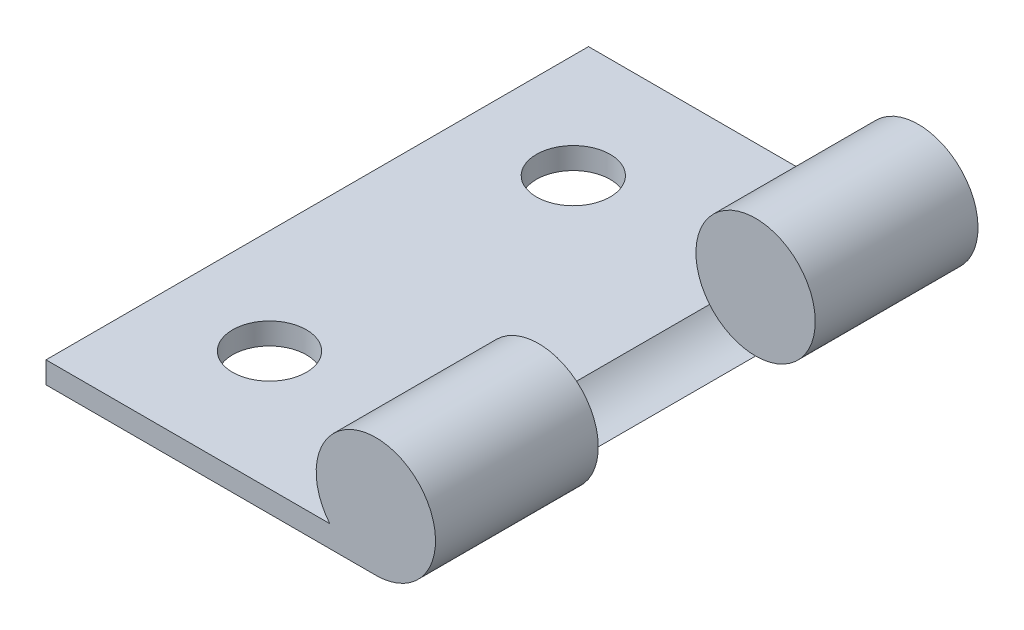
ISO-10303-21;
HEADER;
FILE_DESCRIPTION(('STEP AP214'),'2;1');
FILE_NAME('part.step','',(''),(''),'','','');
FILE_SCHEMA(('AUTOMOTIVE_DESIGN { 1 0 10303 214 1 1 1 1 }'));
ENDSEC;
DATA;
#1=APPLICATION_CONTEXT('core data for automotive mechanical design processes');
#2=APPLICATION_PROTOCOL_DEFINITION('international standard','automotive_design',2000,#1);
#3=PRODUCT_CONTEXT('',#1,'mechanical');
#4=PRODUCT('Part','Part','',(#3));
#5=PRODUCT_RELATED_PRODUCT_CATEGORY('part','',(#4));
#6=PRODUCT_DEFINITION_FORMATION('','',#4);
#7=PRODUCT_DEFINITION_CONTEXT('part definition',#1,'design');
#8=PRODUCT_DEFINITION('design','',#6,#7);
#9=PRODUCT_DEFINITION_SHAPE('','',#8);
#10=(LENGTH_UNIT() NAMED_UNIT(*) SI_UNIT(.MILLI.,.METRE.));
#11=(NAMED_UNIT(*) PLANE_ANGLE_UNIT() SI_UNIT($,.RADIAN.));
#12=(NAMED_UNIT(*) SI_UNIT($,.STERADIAN.) SOLID_ANGLE_UNIT());
#13=UNCERTAINTY_MEASURE_WITH_UNIT(LENGTH_MEASURE(1.E-05),#10,'distance_accuracy_value','');
#14=(GEOMETRIC_REPRESENTATION_CONTEXT(3) GLOBAL_UNCERTAINTY_ASSIGNED_CONTEXT((#13)) GLOBAL_UNIT_ASSIGNED_CONTEXT((#10,
#11,#12)) REPRESENTATION_CONTEXT('',''));
#15=CARTESIAN_POINT('',(0.,0.,0.));
#16=DIRECTION('',(0.,0.,1.));
#17=DIRECTION('',(1.,0.,0.));
#18=AXIS2_PLACEMENT_3D('',#15,#16,#17);
#19=CARTESIAN_POINT('',(0.,0.,25.));
#20=DIRECTION('',(0.,0.,-1.));
#21=DIRECTION('',(-1.,0.,0.));
#22=AXIS2_PLACEMENT_3D('',#19,#20,#21);
#23=CYLINDRICAL_SURFACE('',#22,2.75);
#24=CARTESIAN_POINT('',(0.,0.,17.5));
#25=DIRECTION('',(0.,0.,-1.));
#26=DIRECTION('',(-1.,0.,0.));
#27=AXIS2_PLACEMENT_3D('',#24,#25,#26);
#28=CIRCLE('',#27,2.75);
#29=CARTESIAN_POINT('',(-2.12132034355964,-1.75,17.5));
#30=VERTEX_POINT('',#29);
#31=CARTESIAN_POINT('',(0.,-2.75,17.5));
#32=VERTEX_POINT('',#31);
#33=EDGE_CURVE('E110',#30,#32,#28,.T.);
#34=ORIENTED_EDGE('',*,*,#33,.F.);
#35=DIRECTION('',(0.,0.,-1.));
#36=VECTOR('',#35,1.);
#37=CARTESIAN_POINT('',(-2.12132034355964,-1.75,25.));
#38=LINE('',#37,#36);
#39=CARTESIAN_POINT('',(-2.12132034355964,-1.75,25.));
#40=VERTEX_POINT('',#39);
#41=EDGE_CURVE('E11',#40,#30,#38,.T.);
#42=ORIENTED_EDGE('',*,*,#41,.F.);
#43=CARTESIAN_POINT('',(0.,0.,25.));
#44=DIRECTION('',(0.,0.,1.));
#45=DIRECTION('',(1.,0.,0.));
#46=AXIS2_PLACEMENT_3D('',#43,#44,#45);
#47=CIRCLE('',#46,2.75);
#48=CARTESIAN_POINT('',(0.,-2.75,25.));
#49=VERTEX_POINT('',#48);
#50=EDGE_CURVE('E147',#49,#40,#47,.T.);
#51=ORIENTED_EDGE('',*,*,#50,.F.);
#52=DIRECTION('',(0.,0.,-1.));
#53=VECTOR('',#52,1.);
#54=CARTESIAN_POINT('',(0.,-2.75,25.));
#55=LINE('',#54,#53);
#56=EDGE_CURVE('E105',#49,#32,#55,.T.);
#57=ORIENTED_EDGE('',*,*,#56,.T.);
#58=EDGE_LOOP('',(#34,#42,#51,#57));
#59=FACE_BOUND('',#58,.T.);
#60=ADVANCED_FACE('F34',(#59),#23,.T.);
#61=CARTESIAN_POINT('',(-2.12132034355964,-1.75,7.5));
#62=VERTEX_POINT('',#61);
#63=CARTESIAN_POINT('',(-2.12132034355964,-1.75,0.));
#64=VERTEX_POINT('',#63);
#65=EDGE_CURVE('E43',#62,#64,#38,.T.);
#66=ORIENTED_EDGE('',*,*,#65,.F.);
#67=CARTESIAN_POINT('',(0.,0.,7.5));
#68=DIRECTION('',(0.,0.,-1.));
#69=DIRECTION('',(-1.,0.,0.));
#70=AXIS2_PLACEMENT_3D('',#67,#68,#69);
#71=CIRCLE('',#70,2.75);
#72=CARTESIAN_POINT('',(0.,-2.75,7.5));
#73=VERTEX_POINT('',#72);
#74=EDGE_CURVE('E109',#62,#73,#71,.T.);
#75=ORIENTED_EDGE('',*,*,#74,.T.);
#76=CARTESIAN_POINT('',(0.,-2.75,0.));
#77=VERTEX_POINT('',#76);
#78=EDGE_CURVE('E82',#73,#77,#55,.T.);
#79=ORIENTED_EDGE('',*,*,#78,.T.);
#80=CARTESIAN_POINT('',(0.,0.,0.));
#81=DIRECTION('',(0.,0.,1.));
#82=DIRECTION('',(1.,0.,0.));
#83=AXIS2_PLACEMENT_3D('',#80,#81,#82);
#84=CIRCLE('',#83,2.75);
#85=EDGE_CURVE('E136',#77,#64,#84,.T.);
#86=ORIENTED_EDGE('',*,*,#85,.T.);
#87=EDGE_LOOP('',(#66,#75,#79,#86));
#88=FACE_BOUND('',#87,.T.);
#89=ADVANCED_FACE('F36',(#88),#23,.T.);
#90=CARTESIAN_POINT('',(-15.2,-1.75000000000001,25.));
#91=DIRECTION('',(0.,-1.,0.));
#92=DIRECTION('',(1.,0.,0.));
#93=AXIS2_PLACEMENT_3D('',#90,#91,#92);
#94=PLANE('',#93);
#95=CARTESIAN_POINT('',(-10.4,-1.75000000000001,5.5));
#96=DIRECTION('',(0.,1.,0.));
#97=DIRECTION('',(-1.,0.,0.));
#98=AXIS2_PLACEMENT_3D('',#95,#96,#97);
#99=CIRCLE('',#98,1.7);
#100=CARTESIAN_POINT('',(-12.1,-1.75000000000001,5.5));
#101=VERTEX_POINT('',#100);
#102=EDGE_CURVE('E132',#101,#101,#99,.T.);
#103=ORIENTED_EDGE('',*,*,#102,.F.);
#104=EDGE_LOOP('',(#103));
#105=FACE_BOUND('',#104,.T.);
#106=CARTESIAN_POINT('',(-10.4,-1.75000000000001,19.5));
#107=DIRECTION('',(0.,1.,0.));
#108=DIRECTION('',(1.,0.,0.));
#109=AXIS2_PLACEMENT_3D('',#106,#107,#108);
#110=CIRCLE('',#109,1.7);
#111=CARTESIAN_POINT('',(-8.7,-1.75,19.5));
#112=VERTEX_POINT('',#111);
#113=EDGE_CURVE('E138',#112,#112,#110,.T.);
#114=ORIENTED_EDGE('',*,*,#113,.F.);
#115=EDGE_LOOP('',(#114));
#116=FACE_BOUND('',#115,.T.);
#117=DIRECTION('',(-1.,0.,0.));
#118=VECTOR('',#117,1.);
#119=CARTESIAN_POINT('',(-15.2,-1.75000000000001,0.));
#120=LINE('',#119,#118);
#121=CARTESIAN_POINT('',(-15.2,-1.75000000000001,0.));
#122=VERTEX_POINT('',#121);
#123=EDGE_CURVE('E152',#64,#122,#120,.T.);
#124=ORIENTED_EDGE('',*,*,#123,.T.);
#125=DIRECTION('',(0.,0.,-1.));
#126=VECTOR('',#125,1.);
#127=CARTESIAN_POINT('',(-15.2,-1.75000000000001,25.));
#128=LINE('',#127,#126);
#129=CARTESIAN_POINT('',(-15.2,-1.75000000000001,25.));
#130=VERTEX_POINT('',#129);
#131=EDGE_CURVE('E126',#130,#122,#128,.T.);
#132=ORIENTED_EDGE('',*,*,#131,.F.);
#133=DIRECTION('',(-1.,0.,0.));
#134=VECTOR('',#133,1.);
#135=CARTESIAN_POINT('',(-15.2,-1.75000000000001,25.));
#136=LINE('',#135,#134);
#137=EDGE_CURVE('E89',#40,#130,#136,.T.);
#138=ORIENTED_EDGE('',*,*,#137,.F.);
#139=ORIENTED_EDGE('',*,*,#41,.T.);
#140=DIRECTION('',(0.,0.,-1.));
#141=VECTOR('',#140,1.);
#142=CARTESIAN_POINT('',(-2.12132034355964,-1.75,17.5));
#143=LINE('',#142,#141);
#144=EDGE_CURVE('E143',#30,#62,#143,.T.);
#145=ORIENTED_EDGE('',*,*,#144,.T.);
#146=ORIENTED_EDGE('',*,*,#65,.T.);
#147=EDGE_LOOP('',(#124,#132,#138,#139,#145,#146));
#148=FACE_BOUND('',#147,.T.);
#149=ADVANCED_FACE('F162',(#105,#116,#148),#94,.F.);
#150=CARTESIAN_POINT('',(-15.2,-2.75000000000001,25.));
#151=DIRECTION('',(1.,0.,0.));
#152=DIRECTION('',(0.,1.,0.));
#153=AXIS2_PLACEMENT_3D('',#150,#151,#152);
#154=PLANE('',#153);
#155=DIRECTION('',(0.,-1.,0.));
#156=VECTOR('',#155,1.);
#157=CARTESIAN_POINT('',(-15.2,-2.75000000000001,0.));
#158=LINE('',#157,#156);
#159=CARTESIAN_POINT('',(-15.2,-2.75000000000001,0.));
#160=VERTEX_POINT('',#159);
#161=EDGE_CURVE('E154',#122,#160,#158,.T.);
#162=ORIENTED_EDGE('',*,*,#161,.T.);
#163=DIRECTION('',(0.,0.,-1.));
#164=VECTOR('',#163,1.);
#165=CARTESIAN_POINT('',(-15.2,-2.75000000000001,25.));
#166=LINE('',#165,#164);
#167=CARTESIAN_POINT('',(-15.2,-2.75000000000001,25.));
#168=VERTEX_POINT('',#167);
#169=EDGE_CURVE('E122',#168,#160,#166,.T.);
#170=ORIENTED_EDGE('',*,*,#169,.F.);
#171=DIRECTION('',(0.,-1.,0.));
#172=VECTOR('',#171,1.);
#173=CARTESIAN_POINT('',(-15.2,-2.75000000000001,25.));
#174=LINE('',#173,#172);
#175=EDGE_CURVE('E118',#130,#168,#174,.T.);
#176=ORIENTED_EDGE('',*,*,#175,.F.);
#177=ORIENTED_EDGE('',*,*,#131,.T.);
#178=EDGE_LOOP('',(#162,#170,#176,#177));
#179=FACE_BOUND('',#178,.T.);
#180=ADVANCED_FACE('F157',(#179),#154,.F.);
#181=CARTESIAN_POINT('',(0.,-2.75,25.));
#182=DIRECTION('',(0.,1.,0.));
#183=DIRECTION('',(-1.,0.,0.));
#184=AXIS2_PLACEMENT_3D('',#181,#182,#183);
#185=PLANE('',#184);
#186=CARTESIAN_POINT('',(-10.4,-2.75,5.5));
#187=DIRECTION('',(0.,1.,0.));
#188=DIRECTION('',(-1.,0.,0.));
#189=AXIS2_PLACEMENT_3D('',#186,#187,#188);
#190=CIRCLE('',#189,1.7);
#191=CARTESIAN_POINT('',(-12.1,-2.75,5.5));
#192=VERTEX_POINT('',#191);
#193=EDGE_CURVE('E38',#192,#192,#190,.T.);
#194=ORIENTED_EDGE('',*,*,#193,.T.);
#195=EDGE_LOOP('',(#194));
#196=FACE_BOUND('',#195,.T.);
#197=CARTESIAN_POINT('',(-10.4,-2.75,19.5));
#198=DIRECTION('',(0.,1.,0.));
#199=DIRECTION('',(-1.,0.,0.));
#200=AXIS2_PLACEMENT_3D('',#197,#198,#199);
#201=CIRCLE('',#200,1.7);
#202=CARTESIAN_POINT('',(-12.1,-2.75,19.5));
#203=VERTEX_POINT('',#202);
#204=EDGE_CURVE('E130',#203,#203,#201,.T.);
#205=ORIENTED_EDGE('',*,*,#204,.T.);
#206=EDGE_LOOP('',(#205));
#207=FACE_BOUND('',#206,.T.);
#208=DIRECTION('',(1.,0.,0.));
#209=VECTOR('',#208,1.);
#210=CARTESIAN_POINT('',(0.,-2.75,0.));
#211=LINE('',#210,#209);
#212=EDGE_CURVE('E116',#160,#77,#211,.T.);
#213=ORIENTED_EDGE('',*,*,#212,.T.);
#214=ORIENTED_EDGE('',*,*,#78,.F.);
#215=EDGE_CURVE('E98',#32,#73,#55,.T.);
#216=ORIENTED_EDGE('',*,*,#215,.F.);
#217=ORIENTED_EDGE('',*,*,#56,.F.);
#218=DIRECTION('',(1.,0.,0.));
#219=VECTOR('',#218,1.);
#220=CARTESIAN_POINT('',(0.,-2.75,25.));
#221=LINE('',#220,#219);
#222=EDGE_CURVE('E60',#168,#49,#221,.T.);
#223=ORIENTED_EDGE('',*,*,#222,.F.);
#224=ORIENTED_EDGE('',*,*,#169,.T.);
#225=EDGE_LOOP('',(#213,#214,#216,#217,#223,#224));
#226=FACE_BOUND('',#225,.T.);
#227=ADVANCED_FACE('F113',(#196,#207,#226),#185,.F.);
#228=CARTESIAN_POINT('',(0.,0.,25.));
#229=DIRECTION('',(0.,0.,1.));
#230=DIRECTION('',(1.,0.,0.));
#231=AXIS2_PLACEMENT_3D('',#228,#229,#230);
#232=PLANE('',#231);
#233=ORIENTED_EDGE('',*,*,#50,.T.);
#234=ORIENTED_EDGE('',*,*,#137,.T.);
#235=ORIENTED_EDGE('',*,*,#175,.T.);
#236=ORIENTED_EDGE('',*,*,#222,.T.);
#237=EDGE_LOOP('',(#233,#234,#235,#236));
#238=FACE_BOUND('',#237,.T.);
#239=ADVANCED_FACE('F167',(#238),#232,.T.);
#240=CARTESIAN_POINT('',(0.,0.,0.));
#241=DIRECTION('',(0.,0.,1.));
#242=DIRECTION('',(1.,0.,0.));
#243=AXIS2_PLACEMENT_3D('',#240,#241,#242);
#244=PLANE('',#243);
#245=ORIENTED_EDGE('',*,*,#85,.F.);
#246=ORIENTED_EDGE('',*,*,#212,.F.);
#247=ORIENTED_EDGE('',*,*,#161,.F.);
#248=ORIENTED_EDGE('',*,*,#123,.F.);
#249=EDGE_LOOP('',(#245,#246,#247,#248));
#250=FACE_BOUND('',#249,.T.);
#251=ADVANCED_FACE('F161',(#250),#244,.F.);
#252=CARTESIAN_POINT('',(-10.4,-26.75,19.5));
#253=DIRECTION('',(0.,1.,0.));
#254=DIRECTION('',(-1.,0.,0.));
#255=AXIS2_PLACEMENT_3D('',#252,#253,#254);
#256=CYLINDRICAL_SURFACE('',#255,1.7);
#257=ORIENTED_EDGE('',*,*,#113,.T.);
#258=EDGE_LOOP('',(#257));
#259=FACE_BOUND('',#258,.T.);
#260=ORIENTED_EDGE('',*,*,#204,.F.);
#261=EDGE_LOOP('',(#260));
#262=FACE_BOUND('',#261,.T.);
#263=ADVANCED_FACE('F174',(#259,#262),#256,.F.);
#264=CARTESIAN_POINT('',(-10.4,-26.75,5.5));
#265=DIRECTION('',(0.,1.,0.));
#266=DIRECTION('',(-1.,0.,0.));
#267=AXIS2_PLACEMENT_3D('',#264,#265,#266);
#268=CYLINDRICAL_SURFACE('',#267,1.7);
#269=ORIENTED_EDGE('',*,*,#102,.T.);
#270=EDGE_LOOP('',(#269));
#271=FACE_BOUND('',#270,.T.);
#272=ORIENTED_EDGE('',*,*,#193,.F.);
#273=EDGE_LOOP('',(#272));
#274=FACE_BOUND('',#273,.T.);
#275=ADVANCED_FACE('F196',(#271,#274),#268,.F.);
#276=CARTESIAN_POINT('',(0.,0.,17.5));
#277=DIRECTION('',(0.,0.,-1.));
#278=DIRECTION('',(-1.,0.,0.));
#279=AXIS2_PLACEMENT_3D('',#276,#277,#278);
#280=CYLINDRICAL_SURFACE('',#279,2.75);
#281=EDGE_CURVE('E51',#32,#30,#28,.T.);
#282=ORIENTED_EDGE('',*,*,#281,.F.);
#283=ORIENTED_EDGE('',*,*,#215,.T.);
#284=EDGE_CURVE('E101',#73,#62,#71,.T.);
#285=ORIENTED_EDGE('',*,*,#284,.T.);
#286=ORIENTED_EDGE('',*,*,#144,.F.);
#287=EDGE_LOOP('',(#282,#283,#285,#286));
#288=FACE_BOUND('',#287,.T.);
#289=ADVANCED_FACE('F100',(#288),#280,.F.);
#290=CARTESIAN_POINT('',(0.,0.,17.5));
#291=DIRECTION('',(0.,0.,-1.));
#292=DIRECTION('',(-1.,0.,0.));
#293=AXIS2_PLACEMENT_3D('',#290,#291,#292);
#294=PLANE('',#293);
#295=ORIENTED_EDGE('',*,*,#281,.T.);
#296=ORIENTED_EDGE('',*,*,#33,.T.);
#297=EDGE_LOOP('',(#295,#296));
#298=FACE_BOUND('',#297,.T.);
#299=ADVANCED_FACE('F166',(#298),#294,.T.);
#300=CARTESIAN_POINT('',(0.,0.,7.5));
#301=DIRECTION('',(0.,0.,-1.));
#302=DIRECTION('',(-1.,0.,0.));
#303=AXIS2_PLACEMENT_3D('',#300,#301,#302);
#304=PLANE('',#303);
#305=ORIENTED_EDGE('',*,*,#284,.F.);
#306=ORIENTED_EDGE('',*,*,#74,.F.);
#307=EDGE_LOOP('',(#305,#306));
#308=FACE_BOUND('',#307,.T.);
#309=ADVANCED_FACE('F108',(#308),#304,.F.);
#310=CLOSED_SHELL('',(#60,#89,#149,#180,#227,#239,#251,#263,#275,#289,#299,#309));
#311=MANIFOLD_SOLID_BREP('B2',#310);
#312=ADVANCED_BREP_SHAPE_REPRESENTATION('',(#18,#311),#14);
#313=SHAPE_DEFINITION_REPRESENTATION(#9,#312);
ENDSEC;
END-ISO-10303-21;
